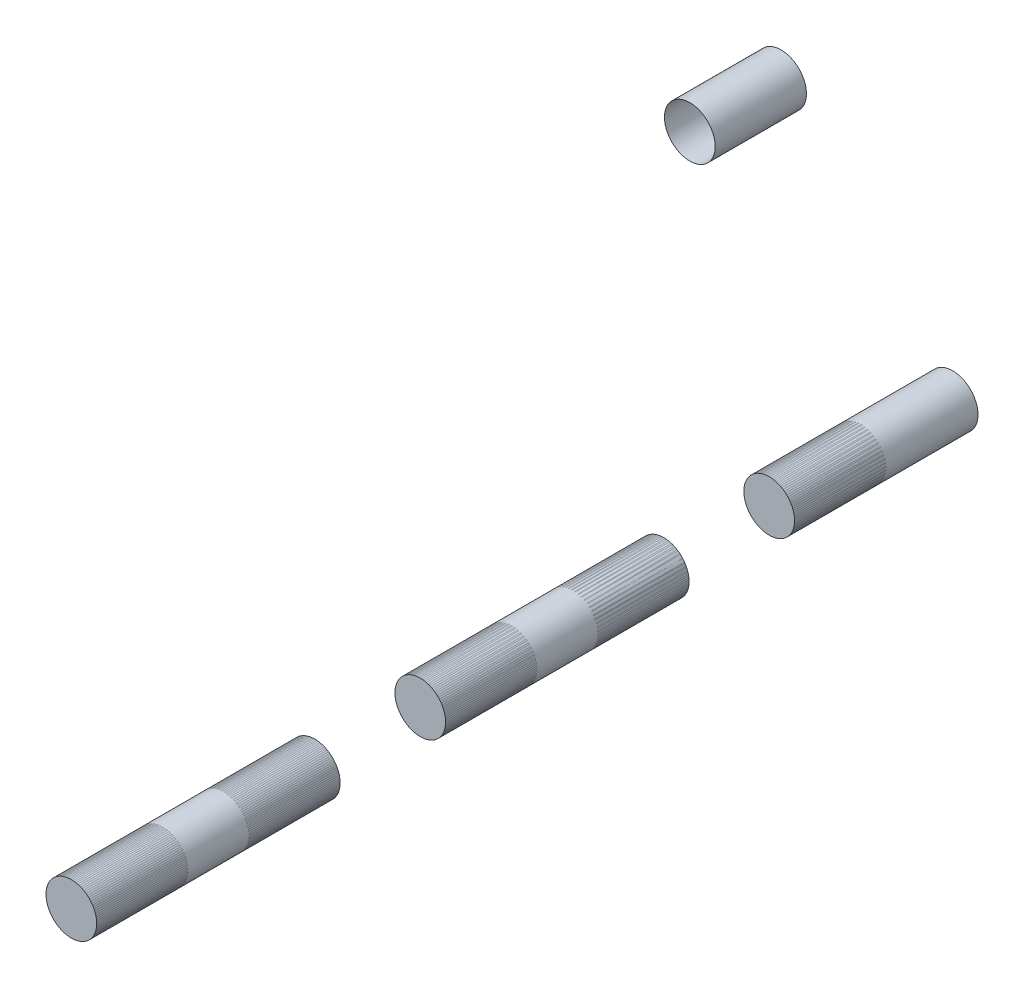
ISO-10303-21;
HEADER;
FILE_DESCRIPTION(('STEP AP214'),'2;1');
FILE_NAME('part.step','',(''),(''),'','','');
FILE_SCHEMA(('AUTOMOTIVE_DESIGN { 1 0 10303 214 1 1 1 1 }'));
ENDSEC;
DATA;
#1=APPLICATION_CONTEXT('core data for automotive mechanical design processes');
#2=APPLICATION_PROTOCOL_DEFINITION('international standard','automotive_design',2000,#1);
#3=PRODUCT_CONTEXT('',#1,'mechanical');
#4=PRODUCT('Part','Part','',(#3));
#5=PRODUCT_RELATED_PRODUCT_CATEGORY('part','',(#4));
#6=PRODUCT_DEFINITION_FORMATION('','',#4);
#7=PRODUCT_DEFINITION_CONTEXT('part definition',#1,'design');
#8=PRODUCT_DEFINITION('design','',#6,#7);
#9=PRODUCT_DEFINITION_SHAPE('','',#8);
#10=(LENGTH_UNIT() NAMED_UNIT(*) SI_UNIT(.MILLI.,.METRE.));
#11=(NAMED_UNIT(*) PLANE_ANGLE_UNIT() SI_UNIT($,.RADIAN.));
#12=(NAMED_UNIT(*) SI_UNIT($,.STERADIAN.) SOLID_ANGLE_UNIT());
#13=UNCERTAINTY_MEASURE_WITH_UNIT(LENGTH_MEASURE(1.E-05),#10,'distance_accuracy_value','');
#14=(GEOMETRIC_REPRESENTATION_CONTEXT(3) GLOBAL_UNCERTAINTY_ASSIGNED_CONTEXT((#13)) GLOBAL_UNIT_ASSIGNED_CONTEXT((#10,
#11,#12)) REPRESENTATION_CONTEXT('',''));
#15=CARTESIAN_POINT('',(0.,0.,0.));
#16=DIRECTION('',(0.,0.,1.));
#17=DIRECTION('',(1.,0.,0.));
#18=AXIS2_PLACEMENT_3D('',#15,#16,#17);
#19=CARTESIAN_POINT('',(42.9683936674829,-48.1019632985591,-40.8205122421383));
#20=DIRECTION('',(0.,0.,1.));
#21=DIRECTION('',(0.,-1.,0.));
#22=AXIS2_PLACEMENT_3D('',#19,#20,#21);
#23=CYLINDRICAL_SURFACE('',#22,6.35);
#24=CARTESIAN_POINT('',(42.9683936674829,-48.1019632985591,23.0862729562589));
#25=DIRECTION('',(0.,0.,-1.));
#26=DIRECTION('',(0.,1.,0.));
#27=AXIS2_PLACEMENT_3D('',#24,#25,#26);
#28=CIRCLE('',#27,6.35);
#29=CARTESIAN_POINT('',(42.9683936674829,-41.7519632985591,23.086272956259));
#30=VERTEX_POINT('',#29);
#31=EDGE_CURVE('E51',#30,#30,#28,.T.);
#32=ORIENTED_EDGE('',*,*,#31,.T.);
#33=EDGE_LOOP('',(#32));
#34=FACE_BOUND('',#33,.T.);
#35=CARTESIAN_POINT('',(42.9683936674829,-48.1019632985591,-22.86));
#36=DIRECTION('',(0.,0.,-1.));
#37=DIRECTION('',(-1.,0.,0.));
#38=AXIS2_PLACEMENT_3D('',#35,#36,#37);
#39=CIRCLE('',#38,6.35);
#40=CARTESIAN_POINT('',(36.6183936674829,-48.1019632985591,-22.86));
#41=VERTEX_POINT('',#40);
#42=EDGE_CURVE('E11',#41,#41,#39,.T.);
#43=ORIENTED_EDGE('',*,*,#42,.F.);
#44=EDGE_LOOP('',(#43));
#45=FACE_BOUND('',#44,.T.);
#46=ADVANCED_FACE('F44',(#34,#45),#23,.T.);
#47=CARTESIAN_POINT('',(42.9683936674829,-48.1019632985591,23.0862729562589));
#48=DIRECTION('',(0.,0.,-1.));
#49=DIRECTION('',(0.,1.,0.));
#50=AXIS2_PLACEMENT_3D('',#47,#48,#49);
#51=PLANE('',#50);
#52=ORIENTED_EDGE('',*,*,#31,.F.);
#53=EDGE_LOOP('',(#52));
#54=FACE_BOUND('',#53,.T.);
#55=ADVANCED_FACE('F59',(#54),#51,.F.);
#56=CARTESIAN_POINT('',(0.,0.,-22.86));
#57=DIRECTION('',(0.,0.,-1.));
#58=DIRECTION('',(-1.,0.,0.));
#59=AXIS2_PLACEMENT_3D('',#56,#57,#58);
#60=PLANE('',#59);
#61=ORIENTED_EDGE('',*,*,#42,.T.);
#62=EDGE_LOOP('',(#61));
#63=FACE_BOUND('',#62,.T.);
#64=ADVANCED_FACE('F46',(#63),#60,.T.);
#65=CLOSED_SHELL('',(#46,#55,#64));
#66=MANIFOLD_SOLID_BREP('B2',#65);
#67=CARTESIAN_POINT('',(0.,0.,49.5022729562589));
#68=DIRECTION('',(0.,0.,-1.));
#69=DIRECTION('',(0.,1.,0.));
#70=AXIS2_PLACEMENT_3D('',#67,#68,#69);
#71=PLANE('',#70);
#72=CARTESIAN_POINT('',(42.9683936674829,-48.1019632985592,49.5022729562589));
#73=DIRECTION('',(0.,0.,-1.));
#74=DIRECTION('',(0.,1.,0.));
#75=AXIS2_PLACEMENT_3D('',#72,#73,#74);
#76=CIRCLE('',#75,6.35);
#77=CARTESIAN_POINT('',(42.9683936674829,-41.7519632985592,49.5022729562589));
#78=VERTEX_POINT('',#77);
#79=EDGE_CURVE('E43',#78,#78,#76,.F.);
#80=ORIENTED_EDGE('',*,*,#79,.F.);
#81=EDGE_LOOP('',(#80));
#82=FACE_BOUND('',#81,.T.);
#83=ADVANCED_FACE('F93',(#82),#71,.T.);
#84=CARTESIAN_POINT('',(42.9683936674829,-48.1019632985592,110.462272956259));
#85=DIRECTION('',(0.,0.,1.));
#86=DIRECTION('',(1.,0.,0.));
#87=AXIS2_PLACEMENT_3D('',#84,#85,#86);
#88=PLANE('',#87);
#89=CARTESIAN_POINT('',(42.9683936674829,-48.1019632985592,110.462272956259));
#90=DIRECTION('',(0.,0.,1.));
#91=DIRECTION('',(1.,0.,0.));
#92=AXIS2_PLACEMENT_3D('',#89,#90,#91);
#93=CIRCLE('',#92,6.35);
#94=CARTESIAN_POINT('',(49.3183936674829,-48.1019632985592,110.462272956259));
#95=VERTEX_POINT('',#94);
#96=EDGE_CURVE('E99',#95,#95,#93,.T.);
#97=ORIENTED_EDGE('',*,*,#96,.T.);
#98=EDGE_LOOP('',(#97));
#99=FACE_BOUND('',#98,.T.);
#100=ADVANCED_FACE('F105',(#99),#88,.T.);
#101=CARTESIAN_POINT('',(42.9683936674829,-48.1019632985592,31.5417607141206));
#102=DIRECTION('',(0.,0.,1.));
#103=DIRECTION('',(1.,0.,0.));
#104=AXIS2_PLACEMENT_3D('',#101,#102,#103);
#105=CYLINDRICAL_SURFACE('',#104,6.35);
#106=ORIENTED_EDGE('',*,*,#96,.F.);
#107=EDGE_LOOP('',(#106));
#108=FACE_BOUND('',#107,.T.);
#109=ORIENTED_EDGE('',*,*,#79,.T.);
#110=EDGE_LOOP('',(#109));
#111=FACE_BOUND('',#110,.T.);
#112=ADVANCED_FACE('F107',(#108,#111),#105,.T.);
#113=CLOSED_SHELL('',(#83,#100,#112));
#114=MANIFOLD_SOLID_BREP('B6',#113);
#115=CARTESIAN_POINT('',(42.9683936674829,-48.1019632985592,118.917760714121));
#116=DIRECTION('',(0.,0.,1.));
#117=DIRECTION('',(1.,0.,0.));
#118=AXIS2_PLACEMENT_3D('',#115,#116,#117);
#119=CYLINDRICAL_SURFACE('',#118,6.35);
#120=CARTESIAN_POINT('',(42.9683936674829,-48.1019632985592,136.878272956259));
#121=DIRECTION('',(0.,0.,1.));
#122=DIRECTION('',(1.,0.,0.));
#123=AXIS2_PLACEMENT_3D('',#120,#121,#122);
#124=CIRCLE('',#123,6.35);
#125=CARTESIAN_POINT('',(49.3183936674829,-48.1019632985592,136.878272956259));
#126=VERTEX_POINT('',#125);
#127=EDGE_CURVE('E92',#126,#126,#124,.F.);
#128=ORIENTED_EDGE('',*,*,#127,.F.);
#129=EDGE_LOOP('',(#128));
#130=FACE_BOUND('',#129,.T.);
#131=CARTESIAN_POINT('',(42.9683936674829,-48.1019632985592,197.838272956259));
#132=DIRECTION('',(0.,0.,1.));
#133=DIRECTION('',(1.,0.,0.));
#134=AXIS2_PLACEMENT_3D('',#131,#132,#133);
#135=CIRCLE('',#134,6.35);
#136=CARTESIAN_POINT('',(49.3183936674829,-48.1019632985592,197.838272956259));
#137=VERTEX_POINT('',#136);
#138=EDGE_CURVE('E148',#137,#137,#135,.T.);
#139=ORIENTED_EDGE('',*,*,#138,.F.);
#140=EDGE_LOOP('',(#139));
#141=FACE_BOUND('',#140,.T.);
#142=ADVANCED_FACE('F142',(#130,#141),#119,.T.);
#143=CARTESIAN_POINT('',(42.9683936674829,-48.1019632985592,197.838272956259));
#144=DIRECTION('',(0.,0.,1.));
#145=DIRECTION('',(1.,0.,0.));
#146=AXIS2_PLACEMENT_3D('',#143,#144,#145);
#147=PLANE('',#146);
#148=ORIENTED_EDGE('',*,*,#138,.T.);
#149=EDGE_LOOP('',(#148));
#150=FACE_BOUND('',#149,.T.);
#151=ADVANCED_FACE('F154',(#150),#147,.T.);
#152=CARTESIAN_POINT('',(0.,0.,136.878272956259));
#153=DIRECTION('',(0.,0.,1.));
#154=DIRECTION('',(1.,0.,0.));
#155=AXIS2_PLACEMENT_3D('',#152,#153,#154);
#156=PLANE('',#155);
#157=ORIENTED_EDGE('',*,*,#127,.T.);
#158=EDGE_LOOP('',(#157));
#159=FACE_BOUND('',#158,.T.);
#160=ADVANCED_FACE('F161',(#159),#156,.F.);
#161=CLOSED_SHELL('',(#142,#151,#160));
#162=MANIFOLD_SOLID_BREP('B38',#161);
#163=CARTESIAN_POINT('',(42.9683936674829,-48.1019632985592,186.408272956259));
#164=DIRECTION('',(0.,0.,1.));
#165=DIRECTION('',(0.998861349822693,0.0477074819120463,0.));
#166=AXIS2_PLACEMENT_3D('',#163,#164,#165);
#167=CYLINDRICAL_SURFACE('',#166,6.35);
#168=CARTESIAN_POINT('',(42.9683936674829,-48.1019632985592,174.978272956259));
#169=DIRECTION('',(0.,0.,1.));
#170=DIRECTION('',(0.998861349822693,0.0477074819120463,0.));
#171=AXIS2_PLACEMENT_3D('',#168,#169,#170);
#172=CIRCLE('',#171,6.35);
#173=CARTESIAN_POINT('',(49.311163238857,-47.7990207884177,174.978272956259));
#174=VERTEX_POINT('',#173);
#175=EDGE_CURVE('E195',#174,#174,#172,.T.);
#176=ORIENTED_EDGE('',*,*,#175,.F.);
#177=EDGE_LOOP('',(#176));
#178=FACE_BOUND('',#177,.T.);
#179=CARTESIAN_POINT('',(42.9683936674829,-48.1019632985592,197.838272956259));
#180=DIRECTION('',(0.,0.,1.));
#181=DIRECTION('',(0.998861349822693,0.0477074819120463,0.));
#182=AXIS2_PLACEMENT_3D('',#179,#180,#181);
#183=CIRCLE('',#182,6.35);
#184=CARTESIAN_POINT('',(49.311163238857,-47.7990207884177,197.838272956259));
#185=VERTEX_POINT('',#184);
#186=EDGE_CURVE('E141',#185,#185,#183,.F.);
#187=ORIENTED_EDGE('',*,*,#186,.F.);
#188=EDGE_LOOP('',(#187));
#189=FACE_BOUND('',#188,.T.);
#190=ADVANCED_FACE('F191',(#178,#189),#167,.F.);
#191=OPEN_SHELL('',(#190));
#192=SHELL_BASED_SURFACE_MODEL('B87',(#191));
#193=CARTESIAN_POINT('',(42.9683936674829,-48.1019632985591,99.032272956259));
#194=DIRECTION('',(0.,0.,1.));
#195=DIRECTION('',(0.0477074819120458,-0.998861349822693,0.));
#196=AXIS2_PLACEMENT_3D('',#193,#194,#195);
#197=CYLINDRICAL_SURFACE('',#196,6.35);
#198=CARTESIAN_POINT('',(42.9683936674829,-48.1019632985591,87.6022729562589));
#199=DIRECTION('',(0.,0.,1.));
#200=DIRECTION('',(0.0477074819120458,-0.998861349822693,0.));
#201=AXIS2_PLACEMENT_3D('',#198,#199,#200);
#202=CIRCLE('',#201,6.35);
#203=CARTESIAN_POINT('',(43.2713361776244,-54.4447328699332,87.6022729562589));
#204=VERTEX_POINT('',#203);
#205=EDGE_CURVE('E190',#204,#204,#202,.T.);
#206=ORIENTED_EDGE('',*,*,#205,.F.);
#207=EDGE_LOOP('',(#206));
#208=FACE_BOUND('',#207,.T.);
#209=CARTESIAN_POINT('',(42.9683936674829,-48.1019632985592,110.462272956259));
#210=DIRECTION('',(0.,0.,1.));
#211=DIRECTION('',(0.0477074819120458,-0.998861349822693,0.));
#212=AXIS2_PLACEMENT_3D('',#209,#210,#211);
#213=CIRCLE('',#212,6.35);
#214=CARTESIAN_POINT('',(43.2713361776244,-54.4447328699333,110.462272956259));
#215=VERTEX_POINT('',#214);
#216=EDGE_CURVE('E227',#215,#215,#213,.F.);
#217=ORIENTED_EDGE('',*,*,#216,.F.);
#218=EDGE_LOOP('',(#217));
#219=FACE_BOUND('',#218,.T.);
#220=ADVANCED_FACE('F223',(#208,#219),#197,.F.);
#221=OPEN_SHELL('',(#220));
#222=SHELL_BASED_SURFACE_MODEL('B136',(#221));
#223=CARTESIAN_POINT('',(42.9683936674829,-48.1019632985592,148.308272956259));
#224=DIRECTION('',(0.,0.,-1.));
#225=DIRECTION('',(-0.0477074819120458,0.998861349822693,0.));
#226=AXIS2_PLACEMENT_3D('',#223,#224,#225);
#227=CYLINDRICAL_SURFACE('',#226,6.35);
#228=CARTESIAN_POINT('',(42.9683936674829,-48.1019632985592,159.738272956259));
#229=DIRECTION('',(0.,0.,-1.));
#230=DIRECTION('',(-0.0477074819120458,0.998861349822693,0.));
#231=AXIS2_PLACEMENT_3D('',#228,#229,#230);
#232=CIRCLE('',#231,6.35);
#233=CARTESIAN_POINT('',(42.6654511573414,-41.7591937271851,159.738272956259));
#234=VERTEX_POINT('',#233);
#235=EDGE_CURVE('E259',#234,#234,#232,.T.);
#236=ORIENTED_EDGE('',*,*,#235,.F.);
#237=EDGE_LOOP('',(#236));
#238=FACE_BOUND('',#237,.T.);
#239=CARTESIAN_POINT('',(42.9683936674829,-48.1019632985592,136.878272956259));
#240=DIRECTION('',(0.,0.,-1.));
#241=DIRECTION('',(-0.0477074819120458,0.998861349822693,0.));
#242=AXIS2_PLACEMENT_3D('',#239,#240,#241);
#243=CIRCLE('',#242,6.35);
#244=CARTESIAN_POINT('',(42.6654511573414,-41.7591937271851,136.878272956259));
#245=VERTEX_POINT('',#244);
#246=EDGE_CURVE('E222',#245,#245,#243,.F.);
#247=ORIENTED_EDGE('',*,*,#246,.F.);
#248=EDGE_LOOP('',(#247));
#249=FACE_BOUND('',#248,.T.);
#250=ADVANCED_FACE('F255',(#238,#249),#227,.F.);
#251=OPEN_SHELL('',(#250));
#252=SHELL_BASED_SURFACE_MODEL('B185',(#251));
#253=CARTESIAN_POINT('',(42.9683936674829,-48.1019632985591,11.6562729562589));
#254=DIRECTION('',(0.,0.,1.));
#255=DIRECTION('',(0.998861349822693,0.0477074819120458,0.));
#256=AXIS2_PLACEMENT_3D('',#253,#254,#255);
#257=CYLINDRICAL_SURFACE('',#256,6.35);
#258=CARTESIAN_POINT('',(42.9683936674829,-48.1019632985591,0.226272956258947));
#259=DIRECTION('',(0.,0.,1.));
#260=DIRECTION('',(0.998861349822693,0.0477074819120458,0.));
#261=AXIS2_PLACEMENT_3D('',#258,#259,#260);
#262=CIRCLE('',#261,6.35);
#263=CARTESIAN_POINT('',(49.311163238857,-47.7990207884176,0.226272956258944));
#264=VERTEX_POINT('',#263);
#265=EDGE_CURVE('E254',#264,#264,#262,.T.);
#266=ORIENTED_EDGE('',*,*,#265,.F.);
#267=EDGE_LOOP('',(#266));
#268=FACE_BOUND('',#267,.T.);
#269=CARTESIAN_POINT('',(42.9683936674829,-48.1019632985591,23.0862729562589));
#270=DIRECTION('',(0.,0.,1.));
#271=DIRECTION('',(0.998861349822693,0.0477074819120458,0.));
#272=AXIS2_PLACEMENT_3D('',#269,#270,#271);
#273=CIRCLE('',#272,6.35);
#274=CARTESIAN_POINT('',(49.311163238857,-47.7990207884176,23.0862729562589));
#275=VERTEX_POINT('',#274);
#276=EDGE_CURVE('E291',#275,#275,#273,.F.);
#277=ORIENTED_EDGE('',*,*,#276,.F.);
#278=EDGE_LOOP('',(#277));
#279=FACE_BOUND('',#278,.T.);
#280=ADVANCED_FACE('F287',(#268,#279),#257,.F.);
#281=OPEN_SHELL('',(#280));
#282=SHELL_BASED_SURFACE_MODEL('B217',(#281));
#283=CARTESIAN_POINT('',(42.9683936674829,-48.1019632985591,60.9322729562589));
#284=DIRECTION('',(0.,0.,-1.));
#285=DIRECTION('',(-0.998861349822693,-0.0477074819120458,0.));
#286=AXIS2_PLACEMENT_3D('',#283,#284,#285);
#287=CYLINDRICAL_SURFACE('',#286,6.35);
#288=CARTESIAN_POINT('',(42.9683936674829,-48.1019632985591,72.3622729562589));
#289=DIRECTION('',(0.,0.,-1.));
#290=DIRECTION('',(-0.998861349822693,-0.0477074819120458,0.));
#291=AXIS2_PLACEMENT_3D('',#288,#289,#290);
#292=CIRCLE('',#291,6.35);
#293=CARTESIAN_POINT('',(36.6256240961089,-48.4049058087006,72.3622729562589));
#294=VERTEX_POINT('',#293);
#295=EDGE_CURVE('E324',#294,#294,#292,.T.);
#296=ORIENTED_EDGE('',*,*,#295,.F.);
#297=EDGE_LOOP('',(#296));
#298=FACE_BOUND('',#297,.T.);
#299=CARTESIAN_POINT('',(42.9683936674829,-48.1019632985591,49.5022729562589));
#300=DIRECTION('',(0.,0.,-1.));
#301=DIRECTION('',(-0.998861349822693,-0.0477074819120458,0.));
#302=AXIS2_PLACEMENT_3D('',#299,#300,#301);
#303=CIRCLE('',#302,6.35);
#304=CARTESIAN_POINT('',(36.6256240961088,-48.4049058087006,49.5022729562589));
#305=VERTEX_POINT('',#304);
#306=EDGE_CURVE('E286',#305,#305,#303,.F.);
#307=ORIENTED_EDGE('',*,*,#306,.F.);
#308=EDGE_LOOP('',(#307));
#309=FACE_BOUND('',#308,.T.);
#310=ADVANCED_FACE('F320',(#298,#309),#287,.F.);
#311=OPEN_SHELL('',(#310));
#312=SHELL_BASED_SURFACE_MODEL('B249',(#311));
#313=CARTESIAN_POINT('',(0.,0.,-11.43));
#314=DIRECTION('',(0.,0.,-1.));
#315=DIRECTION('',(-1.,0.,0.));
#316=AXIS2_PLACEMENT_3D('',#313,#314,#315);
#317=CYLINDRICAL_SURFACE('',#316,6.35);
#318=CARTESIAN_POINT('',(0.,0.,0.));
#319=DIRECTION('',(0.,0.,-1.));
#320=DIRECTION('',(-1.,0.,0.));
#321=AXIS2_PLACEMENT_3D('',#318,#319,#320);
#322=CIRCLE('',#321,6.35);
#323=CARTESIAN_POINT('',(-6.35000000000001,0.,0.));
#324=VERTEX_POINT('',#323);
#325=EDGE_CURVE('E362',#324,#324,#322,.T.);
#326=ORIENTED_EDGE('',*,*,#325,.F.);
#327=EDGE_LOOP('',(#326));
#328=FACE_BOUND('',#327,.T.);
#329=CARTESIAN_POINT('',(0.,0.,-22.86));
#330=DIRECTION('',(0.,0.,-1.));
#331=DIRECTION('',(-1.,0.,0.));
#332=AXIS2_PLACEMENT_3D('',#329,#330,#331);
#333=CIRCLE('',#332,6.35);
#334=CARTESIAN_POINT('',(-6.35,0.,-22.86));
#335=VERTEX_POINT('',#334);
#336=EDGE_CURVE('E319',#335,#335,#333,.F.);
#337=ORIENTED_EDGE('',*,*,#336,.F.);
#338=EDGE_LOOP('',(#337));
#339=FACE_BOUND('',#338,.T.);
#340=ADVANCED_FACE('F358',(#328,#339),#317,.F.);
#341=OPEN_SHELL('',(#340));
#342=SHELL_BASED_SURFACE_MODEL('B281',(#341));
#343=ADVANCED_BREP_SHAPE_REPRESENTATION('',(#18,#66,#114,#162),#14);
#344=MANIFOLD_SURFACE_SHAPE_REPRESENTATION('',(#18,#192,#222,#252,#282,#312,#342),#14);
#345=SHAPE_REPRESENTATION('',(#18),#14);
#346=SHAPE_DEFINITION_REPRESENTATION(#9,#345);
#347=SHAPE_REPRESENTATION_RELATIONSHIP('','',#345,#343);
#348=SHAPE_REPRESENTATION_RELATIONSHIP('','',#345,#344);
ENDSEC;
END-ISO-10303-21;
